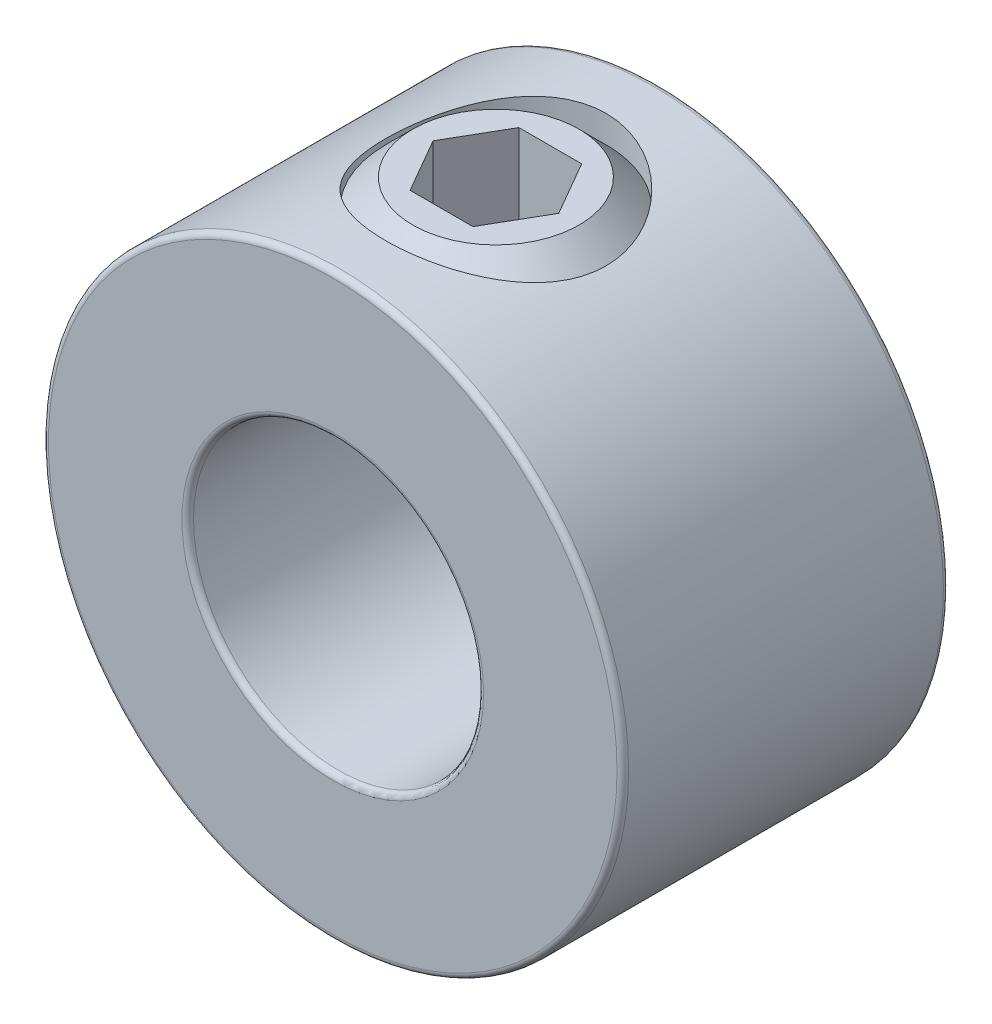
ISO-10303-21;
HEADER;
FILE_DESCRIPTION(('STEP AP214'),'2;1');
FILE_NAME('part.step','',(''),(''),'','','');
FILE_SCHEMA(('AUTOMOTIVE_DESIGN { 1 0 10303 214 1 1 1 1 }'));
ENDSEC;
DATA;
#1=APPLICATION_CONTEXT('core data for automotive mechanical design processes');
#2=APPLICATION_PROTOCOL_DEFINITION('international standard','automotive_design',2000,#1);
#3=PRODUCT_CONTEXT('',#1,'mechanical');
#4=PRODUCT('Part','Part','',(#3));
#5=PRODUCT_RELATED_PRODUCT_CATEGORY('part','',(#4));
#6=PRODUCT_DEFINITION_FORMATION('','',#4);
#7=PRODUCT_DEFINITION_CONTEXT('part definition',#1,'design');
#8=PRODUCT_DEFINITION('design','',#6,#7);
#9=PRODUCT_DEFINITION_SHAPE('','',#8);
#10=(LENGTH_UNIT() NAMED_UNIT(*) SI_UNIT(.MILLI.,.METRE.));
#11=(NAMED_UNIT(*) PLANE_ANGLE_UNIT() SI_UNIT($,.RADIAN.));
#12=(NAMED_UNIT(*) SI_UNIT($,.STERADIAN.) SOLID_ANGLE_UNIT());
#13=UNCERTAINTY_MEASURE_WITH_UNIT(LENGTH_MEASURE(1.E-05),#10,'distance_accuracy_value','');
#14=(GEOMETRIC_REPRESENTATION_CONTEXT(3) GLOBAL_UNCERTAINTY_ASSIGNED_CONTEXT((#13)) GLOBAL_UNIT_ASSIGNED_CONTEXT((#10,
#11,#12)) REPRESENTATION_CONTEXT('',''));
#15=CARTESIAN_POINT('',(0.,0.,0.));
#16=DIRECTION('',(0.,0.,1.));
#17=DIRECTION('',(1.,0.,0.));
#18=AXIS2_PLACEMENT_3D('',#15,#16,#17);
#19=CARTESIAN_POINT('',(0.,6.35,0.));
#20=DIRECTION('',(0.,1.,0.));
#21=DIRECTION('',(-1.,0.,0.));
#22=AXIS2_PLACEMENT_3D('',#19,#20,#21);
#23=PLANE('',#22);
#24=CARTESIAN_POINT('',(0.,6.35,0.));
#25=DIRECTION('',(0.,1.,0.));
#26=DIRECTION('',(-1.,0.,0.));
#27=AXIS2_PLACEMENT_3D('',#24,#25,#26);
#28=CIRCLE('',#27,1.81975161629017);
#29=CARTESIAN_POINT('',(-1.81975161629017,6.35,0.));
#30=VERTEX_POINT('',#29);
#31=EDGE_CURVE('E12',#30,#30,#28,.T.);
#32=ORIENTED_EDGE('',*,*,#31,.T.);
#33=EDGE_LOOP('',(#32));
#34=FACE_BOUND('',#33,.T.);
#35=DIRECTION('',(1.,0.,0.));
#36=VECTOR('',#35,1.);
#37=CARTESIAN_POINT('',(-0.687407664253899,6.34999999999999,-1.190625));
#38=LINE('',#37,#36);
#39=CARTESIAN_POINT('',(-0.687407664253899,6.34999999999999,-1.190625));
#40=VERTEX_POINT('',#39);
#41=CARTESIAN_POINT('',(0.687407664253899,6.35,-1.190625));
#42=VERTEX_POINT('',#41);
#43=EDGE_CURVE('E122',#40,#42,#38,.T.);
#44=ORIENTED_EDGE('',*,*,#43,.T.);
#45=DIRECTION('',(0.5,0.,0.866025403784439));
#46=VECTOR('',#45,1.);
#47=CARTESIAN_POINT('',(0.687407664253899,6.34999999999999,-1.190625));
#48=LINE('',#47,#46);
#49=CARTESIAN_POINT('',(1.3748153285078,6.34999999999999,0.));
#50=VERTEX_POINT('',#49);
#51=EDGE_CURVE('E66',#42,#50,#48,.T.);
#52=ORIENTED_EDGE('',*,*,#51,.T.);
#53=DIRECTION('',(-0.5,0.,0.866025403784439));
#54=VECTOR('',#53,1.);
#55=CARTESIAN_POINT('',(1.3748153285078,6.34999999999999,0.));
#56=LINE('',#55,#54);
#57=CARTESIAN_POINT('',(0.687407664253899,6.34999999999999,1.190625));
#58=VERTEX_POINT('',#57);
#59=EDGE_CURVE('E126',#50,#58,#56,.T.);
#60=ORIENTED_EDGE('',*,*,#59,.T.);
#61=DIRECTION('',(-1.,0.,0.));
#62=VECTOR('',#61,1.);
#63=CARTESIAN_POINT('',(0.687407664253899,6.34999999999999,1.190625));
#64=LINE('',#63,#62);
#65=CARTESIAN_POINT('',(-0.687407664253899,6.34999999999999,1.190625));
#66=VERTEX_POINT('',#65);
#67=EDGE_CURVE('E205',#58,#66,#64,.T.);
#68=ORIENTED_EDGE('',*,*,#67,.T.);
#69=DIRECTION('',(-0.5,0.,-0.866025403784439));
#70=VECTOR('',#69,1.);
#71=CARTESIAN_POINT('',(-0.687407664253899,6.34999999999999,1.190625));
#72=LINE('',#71,#70);
#73=CARTESIAN_POINT('',(-1.3748153285078,6.34999999999999,0.));
#74=VERTEX_POINT('',#73);
#75=EDGE_CURVE('E185',#66,#74,#72,.T.);
#76=ORIENTED_EDGE('',*,*,#75,.T.);
#77=DIRECTION('',(0.5,0.,-0.866025403784439));
#78=VECTOR('',#77,1.);
#79=CARTESIAN_POINT('',(-1.3748153285078,6.34999999999999,0.));
#80=LINE('',#79,#78);
#81=EDGE_CURVE('E178',#74,#40,#80,.T.);
#82=ORIENTED_EDGE('',*,*,#81,.T.);
#83=EDGE_LOOP('',(#44,#52,#60,#68,#76,#82));
#84=FACE_BOUND('',#83,.T.);
#85=ADVANCED_FACE('F51',(#34,#84),#23,.T.);
#86=CARTESIAN_POINT('',(0.,6.35,0.));
#87=DIRECTION('',(0.,-1.,0.));
#88=DIRECTION('',(1.,0.,0.));
#89=AXIS2_PLACEMENT_3D('',#86,#87,#88);
#90=CONICAL_SURFACE('',#89,1.81975161629017,0.785398163397449);
#91=CARTESIAN_POINT('',(0.,5.75675161629017,0.));
#92=DIRECTION('',(0.,1.,0.));
#93=DIRECTION('',(-1.,0.,0.));
#94=AXIS2_PLACEMENT_3D('',#91,#92,#93);
#95=CIRCLE('',#94,2.413);
#96=CARTESIAN_POINT('',(-2.413,5.75675161629017,0.));
#97=VERTEX_POINT('',#96);
#98=EDGE_CURVE('E59',#97,#97,#95,.T.);
#99=ORIENTED_EDGE('',*,*,#98,.T.);
#100=EDGE_LOOP('',(#99));
#101=FACE_BOUND('',#100,.T.);
#102=ORIENTED_EDGE('',*,*,#31,.F.);
#103=EDGE_LOOP('',(#102));
#104=FACE_BOUND('',#103,.T.);
#105=ADVANCED_FACE('F152',(#101,#104),#90,.T.);
#106=CARTESIAN_POINT('',(0.,3.175,0.));
#107=DIRECTION('',(0.,1.,0.));
#108=DIRECTION('',(-1.,0.,0.));
#109=AXIS2_PLACEMENT_3D('',#106,#107,#108);
#110=CYLINDRICAL_SURFACE('',#109,2.413);
#111=CARTESIAN_POINT('',(0.,3.76824838370983,0.));
#112=DIRECTION('',(0.,1.,0.));
#113=DIRECTION('',(-1.,0.,0.));
#114=AXIS2_PLACEMENT_3D('',#111,#112,#113);
#115=CIRCLE('',#114,2.413);
#116=CARTESIAN_POINT('',(-2.413,3.76824838370983,0.));
#117=VERTEX_POINT('',#116);
#118=EDGE_CURVE('E144',#117,#117,#115,.T.);
#119=ORIENTED_EDGE('',*,*,#118,.T.);
#120=EDGE_LOOP('',(#119));
#121=FACE_BOUND('',#120,.T.);
#122=ORIENTED_EDGE('',*,*,#98,.F.);
#123=EDGE_LOOP('',(#122));
#124=FACE_BOUND('',#123,.T.);
#125=ADVANCED_FACE('F155',(#121,#124),#110,.T.);
#126=CARTESIAN_POINT('',(0.,3.76824838370983,0.));
#127=DIRECTION('',(0.,1.,0.));
#128=DIRECTION('',(-1.,0.,0.));
#129=AXIS2_PLACEMENT_3D('',#126,#127,#128);
#130=CONICAL_SURFACE('',#129,2.413,0.785398163397448);
#131=CARTESIAN_POINT('',(0.,3.175,0.));
#132=DIRECTION('',(0.,1.,0.));
#133=DIRECTION('',(-1.,0.,0.));
#134=AXIS2_PLACEMENT_3D('',#131,#132,#133);
#135=CIRCLE('',#134,1.81975161629017);
#136=CARTESIAN_POINT('',(-1.81975161629017,3.175,0.));
#137=VERTEX_POINT('',#136);
#138=EDGE_CURVE('E135',#137,#137,#135,.T.);
#139=ORIENTED_EDGE('',*,*,#138,.T.);
#140=EDGE_LOOP('',(#139));
#141=FACE_BOUND('',#140,.T.);
#142=ORIENTED_EDGE('',*,*,#118,.F.);
#143=EDGE_LOOP('',(#142));
#144=FACE_BOUND('',#143,.T.);
#145=ADVANCED_FACE('F157',(#141,#144),#130,.T.);
#146=CARTESIAN_POINT('',(-1.81975161629017,3.175,0.));
#147=DIRECTION('',(0.,-1.,0.));
#148=DIRECTION('',(1.,0.,0.));
#149=AXIS2_PLACEMENT_3D('',#146,#147,#148);
#150=PLANE('',#149);
#151=CARTESIAN_POINT('',(0.,3.175,0.));
#152=DIRECTION('',(0.,1.,0.));
#153=DIRECTION('',(-1.,0.,0.));
#154=AXIS2_PLACEMENT_3D('',#151,#152,#153);
#155=CIRCLE('',#154,0.711898060451796);
#156=CARTESIAN_POINT('',(-0.711898060451796,3.175,0.));
#157=VERTEX_POINT('',#156);
#158=EDGE_CURVE('E128',#157,#157,#155,.T.);
#159=ORIENTED_EDGE('',*,*,#158,.T.);
#160=EDGE_LOOP('',(#159));
#161=FACE_BOUND('',#160,.T.);
#162=ORIENTED_EDGE('',*,*,#138,.F.);
#163=EDGE_LOOP('',(#162));
#164=FACE_BOUND('',#163,.T.);
#165=ADVANCED_FACE('F164',(#161,#164),#150,.T.);
#166=CARTESIAN_POINT('',(0.,3.175,0.));
#167=DIRECTION('',(0.,-1.,0.));
#168=DIRECTION('',(1.,0.,0.));
#169=AXIS2_PLACEMENT_3D('',#166,#167,#168);
#170=CONICAL_SURFACE('',#169,0.711898060451796,0.785398163397448);
#171=CARTESIAN_POINT('',(0.,3.8868980604518,0.));
#172=VERTEX_POINT('',#171);
#173=VERTEX_LOOP('',#172);
#174=FACE_BOUND('',#173,.T.);
#175=ORIENTED_EDGE('',*,*,#158,.F.);
#176=EDGE_LOOP('',(#175));
#177=FACE_BOUND('',#176,.T.);
#178=ADVANCED_FACE('F257',(#174,#177),#170,.F.);
#179=CARTESIAN_POINT('',(0.687407664253899,3.96874999999999,-1.190625));
#180=DIRECTION('',(-0.866025403784439,0.,0.5));
#181=DIRECTION('',(0.5,0.,0.866025403784438));
#182=AXIS2_PLACEMENT_3D('',#179,#180,#181);
#183=PLANE('',#182);
#184=ORIENTED_EDGE('',*,*,#51,.F.);
#185=DIRECTION('',(0.,1.,0.));
#186=VECTOR('',#185,1.);
#187=CARTESIAN_POINT('',(0.687407664253899,3.96874999999999,-1.190625));
#188=LINE('',#187,#186);
#189=CARTESIAN_POINT('',(0.687407664253899,3.96874999999999,-1.190625));
#190=VERTEX_POINT('',#189);
#191=EDGE_CURVE('E120',#190,#42,#188,.T.);
#192=ORIENTED_EDGE('',*,*,#191,.F.);
#193=DIRECTION('',(0.5,0.,0.866025403784439));
#194=VECTOR('',#193,1.);
#195=CARTESIAN_POINT('',(0.687407664253899,3.96874999999999,-1.190625));
#196=LINE('',#195,#194);
#197=CARTESIAN_POINT('',(1.3748153285078,3.96874999999999,0.));
#198=VERTEX_POINT('',#197);
#199=EDGE_CURVE('E110',#190,#198,#196,.T.);
#200=ORIENTED_EDGE('',*,*,#199,.T.);
#201=DIRECTION('',(0.,1.,0.));
#202=VECTOR('',#201,1.);
#203=CARTESIAN_POINT('',(1.3748153285078,3.96874999999999,0.));
#204=LINE('',#203,#202);
#205=EDGE_CURVE('E119',#198,#50,#204,.T.);
#206=ORIENTED_EDGE('',*,*,#205,.T.);
#207=EDGE_LOOP('',(#184,#192,#200,#206));
#208=FACE_BOUND('',#207,.T.);
#209=ADVANCED_FACE('F118',(#208),#183,.T.);
#210=CARTESIAN_POINT('',(1.3748153285078,3.96874999999999,0.));
#211=DIRECTION('',(-0.866025403784439,0.,-0.5));
#212=DIRECTION('',(-0.5,0.,0.866025403784439));
#213=AXIS2_PLACEMENT_3D('',#210,#211,#212);
#214=PLANE('',#213);
#215=ORIENTED_EDGE('',*,*,#59,.F.);
#216=ORIENTED_EDGE('',*,*,#205,.F.);
#217=DIRECTION('',(-0.5,0.,0.866025403784439));
#218=VECTOR('',#217,1.);
#219=CARTESIAN_POINT('',(1.3748153285078,3.96874999999999,0.));
#220=LINE('',#219,#218);
#221=CARTESIAN_POINT('',(0.687407664253899,3.96874999999999,1.190625));
#222=VERTEX_POINT('',#221);
#223=EDGE_CURVE('E106',#198,#222,#220,.T.);
#224=ORIENTED_EDGE('',*,*,#223,.T.);
#225=DIRECTION('',(0.,1.,0.));
#226=VECTOR('',#225,1.);
#227=CARTESIAN_POINT('',(0.687407664253899,3.96874999999999,1.190625));
#228=LINE('',#227,#226);
#229=EDGE_CURVE('E129',#222,#58,#228,.T.);
#230=ORIENTED_EDGE('',*,*,#229,.T.);
#231=EDGE_LOOP('',(#215,#216,#224,#230));
#232=FACE_BOUND('',#231,.T.);
#233=ADVANCED_FACE('F124',(#232),#214,.T.);
#234=CARTESIAN_POINT('',(0.687407664253899,3.96874999999999,1.190625));
#235=DIRECTION('',(0.,0.,-1.));
#236=DIRECTION('',(-1.,0.,0.));
#237=AXIS2_PLACEMENT_3D('',#234,#235,#236);
#238=PLANE('',#237);
#239=ORIENTED_EDGE('',*,*,#67,.F.);
#240=ORIENTED_EDGE('',*,*,#229,.F.);
#241=DIRECTION('',(-1.,0.,0.));
#242=VECTOR('',#241,1.);
#243=CARTESIAN_POINT('',(0.687407664253899,3.96874999999999,1.190625));
#244=LINE('',#243,#242);
#245=CARTESIAN_POINT('',(-0.687407664253899,3.96874999999999,1.190625));
#246=VERTEX_POINT('',#245);
#247=EDGE_CURVE('E112',#222,#246,#244,.T.);
#248=ORIENTED_EDGE('',*,*,#247,.T.);
#249=DIRECTION('',(0.,1.,0.));
#250=VECTOR('',#249,1.);
#251=CARTESIAN_POINT('',(-0.687407664253899,3.96874999999999,1.190625));
#252=LINE('',#251,#250);
#253=EDGE_CURVE('E137',#246,#66,#252,.T.);
#254=ORIENTED_EDGE('',*,*,#253,.T.);
#255=EDGE_LOOP('',(#239,#240,#248,#254));
#256=FACE_BOUND('',#255,.T.);
#257=ADVANCED_FACE('F203',(#256),#238,.T.);
#258=CARTESIAN_POINT('',(-0.687407664253899,3.96874999999999,1.190625));
#259=DIRECTION('',(0.866025403784439,0.,-0.5));
#260=DIRECTION('',(-0.5,0.,-0.866025403784438));
#261=AXIS2_PLACEMENT_3D('',#258,#259,#260);
#262=PLANE('',#261);
#263=ORIENTED_EDGE('',*,*,#75,.F.);
#264=ORIENTED_EDGE('',*,*,#253,.F.);
#265=DIRECTION('',(-0.5,0.,-0.866025403784439));
#266=VECTOR('',#265,1.);
#267=CARTESIAN_POINT('',(-0.687407664253899,3.96874999999999,1.190625));
#268=LINE('',#267,#266);
#269=CARTESIAN_POINT('',(-1.3748153285078,3.96874999999999,0.));
#270=VERTEX_POINT('',#269);
#271=EDGE_CURVE('E223',#246,#270,#268,.T.);
#272=ORIENTED_EDGE('',*,*,#271,.T.);
#273=DIRECTION('',(0.,1.,0.));
#274=VECTOR('',#273,1.);
#275=CARTESIAN_POINT('',(-1.3748153285078,3.96874999999999,0.));
#276=LINE('',#275,#274);
#277=EDGE_CURVE('E195',#270,#74,#276,.T.);
#278=ORIENTED_EDGE('',*,*,#277,.T.);
#279=EDGE_LOOP('',(#263,#264,#272,#278));
#280=FACE_BOUND('',#279,.T.);
#281=ADVANCED_FACE('F207',(#280),#262,.T.);
#282=CARTESIAN_POINT('',(-1.3748153285078,3.96874999999999,0.));
#283=DIRECTION('',(0.866025403784439,0.,0.5));
#284=DIRECTION('',(0.5,0.,-0.866025403784439));
#285=AXIS2_PLACEMENT_3D('',#282,#283,#284);
#286=PLANE('',#285);
#287=ORIENTED_EDGE('',*,*,#81,.F.);
#288=ORIENTED_EDGE('',*,*,#277,.F.);
#289=DIRECTION('',(0.5,0.,-0.866025403784439));
#290=VECTOR('',#289,1.);
#291=CARTESIAN_POINT('',(-1.3748153285078,3.96874999999999,0.));
#292=LINE('',#291,#290);
#293=CARTESIAN_POINT('',(-0.687407664253899,3.96874999999999,-1.190625));
#294=VERTEX_POINT('',#293);
#295=EDGE_CURVE('E220',#270,#294,#292,.T.);
#296=ORIENTED_EDGE('',*,*,#295,.T.);
#297=DIRECTION('',(0.,1.,0.));
#298=VECTOR('',#297,1.);
#299=CARTESIAN_POINT('',(-0.687407664253899,3.96874999999999,-1.190625));
#300=LINE('',#299,#298);
#301=EDGE_CURVE('E191',#294,#40,#300,.T.);
#302=ORIENTED_EDGE('',*,*,#301,.T.);
#303=EDGE_LOOP('',(#287,#288,#296,#302));
#304=FACE_BOUND('',#303,.T.);
#305=ADVANCED_FACE('F238',(#304),#286,.T.);
#306=CARTESIAN_POINT('',(-0.687407664253899,3.96874999999999,-1.190625));
#307=DIRECTION('',(0.,0.,1.));
#308=DIRECTION('',(1.,0.,0.));
#309=AXIS2_PLACEMENT_3D('',#306,#307,#308);
#310=PLANE('',#309);
#311=ORIENTED_EDGE('',*,*,#43,.F.);
#312=ORIENTED_EDGE('',*,*,#301,.F.);
#313=DIRECTION('',(1.,0.,0.));
#314=VECTOR('',#313,1.);
#315=CARTESIAN_POINT('',(-0.687407664253899,3.96874999999999,-1.190625));
#316=LINE('',#315,#314);
#317=EDGE_CURVE('E192',#294,#190,#316,.T.);
#318=ORIENTED_EDGE('',*,*,#317,.T.);
#319=ORIENTED_EDGE('',*,*,#191,.T.);
#320=EDGE_LOOP('',(#311,#312,#318,#319));
#321=FACE_BOUND('',#320,.T.);
#322=ADVANCED_FACE('F239',(#321),#310,.T.);
#323=CARTESIAN_POINT('',(1.3748153285078,3.96874999999999,0.));
#324=DIRECTION('',(0.,-1.,0.));
#325=DIRECTION('',(0.,0.,-1.));
#326=AXIS2_PLACEMENT_3D('',#323,#324,#325);
#327=PLANE('',#326);
#328=ORIENTED_EDGE('',*,*,#199,.F.);
#329=ORIENTED_EDGE('',*,*,#317,.F.);
#330=ORIENTED_EDGE('',*,*,#295,.F.);
#331=ORIENTED_EDGE('',*,*,#271,.F.);
#332=ORIENTED_EDGE('',*,*,#247,.F.);
#333=ORIENTED_EDGE('',*,*,#223,.F.);
#334=EDGE_LOOP('',(#328,#329,#330,#331,#332,#333));
#335=FACE_BOUND('',#334,.T.);
#336=ADVANCED_FACE('F108',(#335),#327,.F.);
#337=CLOSED_SHELL('',(#85,#105,#125,#145,#165,#178,#209,#233,#257,#281,#305,#322,#336));
#338=MANIFOLD_SOLID_BREP('B2',#337);
#339=CARTESIAN_POINT('',(0.,0.,3.571875));
#340=DIRECTION('',(0.,0.,1.));
#341=DIRECTION('',(1.,0.,0.));
#342=AXIS2_PLACEMENT_3D('',#339,#340,#341);
#343=PLANE('',#342);
#344=CARTESIAN_POINT('',(0.,0.,3.571875));
#345=DIRECTION('',(0.,0.,1.));
#346=DIRECTION('',(1.,0.,0.));
#347=AXIS2_PLACEMENT_3D('',#344,#345,#346);
#348=CIRCLE('',#347,3.302);
#349=CARTESIAN_POINT('',(3.302,0.,3.571875));
#350=VERTEX_POINT('',#349);
#351=EDGE_CURVE('E366',#350,#350,#348,.F.);
#352=ORIENTED_EDGE('',*,*,#351,.T.);
#353=EDGE_LOOP('',(#352));
#354=FACE_BOUND('',#353,.T.);
#355=CARTESIAN_POINT('',(0.,0.,3.571875));
#356=DIRECTION('',(0.,0.,1.));
#357=DIRECTION('',(1.,0.,0.));
#358=AXIS2_PLACEMENT_3D('',#355,#356,#357);
#359=CIRCLE('',#358,6.223);
#360=CARTESIAN_POINT('',(6.223,0.,3.571875));
#361=VERTEX_POINT('',#360);
#362=EDGE_CURVE('E372',#361,#361,#359,.T.);
#363=ORIENTED_EDGE('',*,*,#362,.T.);
#364=EDGE_LOOP('',(#363));
#365=FACE_BOUND('',#364,.T.);
#366=ADVANCED_FACE('F352',(#354,#365),#343,.T.);
#367=CARTESIAN_POINT('',(0.,0.,-3.571875));
#368=DIRECTION('',(0.,0.,1.));
#369=DIRECTION('',(1.,0.,0.));
#370=AXIS2_PLACEMENT_3D('',#367,#368,#369);
#371=PLANE('',#370);
#372=CARTESIAN_POINT('',(0.,0.,-3.571875));
#373=DIRECTION('',(0.,0.,1.));
#374=DIRECTION('',(1.,0.,0.));
#375=AXIS2_PLACEMENT_3D('',#372,#373,#374);
#376=CIRCLE('',#375,3.302);
#377=CARTESIAN_POINT('',(3.302,0.,-3.571875));
#378=VERTEX_POINT('',#377);
#379=EDGE_CURVE('E386',#378,#378,#376,.T.);
#380=ORIENTED_EDGE('',*,*,#379,.T.);
#381=EDGE_LOOP('',(#380));
#382=FACE_BOUND('',#381,.T.);
#383=CARTESIAN_POINT('',(0.,0.,-3.571875));
#384=DIRECTION('',(0.,0.,1.));
#385=DIRECTION('',(1.,0.,0.));
#386=AXIS2_PLACEMENT_3D('',#383,#384,#385);
#387=CIRCLE('',#386,6.223);
#388=CARTESIAN_POINT('',(6.223,0.,-3.571875));
#389=VERTEX_POINT('',#388);
#390=EDGE_CURVE('E390',#389,#389,#387,.F.);
#391=ORIENTED_EDGE('',*,*,#390,.T.);
#392=EDGE_LOOP('',(#391));
#393=FACE_BOUND('',#392,.T.);
#394=ADVANCED_FACE('F428',(#382,#393),#371,.F.);
#395=CARTESIAN_POINT('',(0.,0.,3.571875));
#396=DIRECTION('',(0.,0.,-1.));
#397=DIRECTION('',(-1.,0.,0.));
#398=AXIS2_PLACEMENT_3D('',#395,#396,#397);
#399=CYLINDRICAL_SURFACE('',#398,6.35);
#400=CARTESIAN_POINT('',(0.,0.,-3.444875));
#401=DIRECTION('',(0.,0.,1.));
#402=DIRECTION('',(1.,0.,0.));
#403=AXIS2_PLACEMENT_3D('',#400,#401,#402);
#404=CIRCLE('',#403,6.35);
#405=CARTESIAN_POINT('',(6.35,0.,-3.444875));
#406=VERTEX_POINT('',#405);
#407=EDGE_CURVE('E50',#406,#406,#404,.T.);
#408=ORIENTED_EDGE('',*,*,#407,.T.);
#409=EDGE_LOOP('',(#408));
#410=FACE_BOUND('',#409,.T.);
#411=CARTESIAN_POINT('',(0.,0.,3.444875));
#412=DIRECTION('',(0.,0.,1.));
#413=DIRECTION('',(1.,0.,0.));
#414=AXIS2_PLACEMENT_3D('',#411,#412,#413);
#415=CIRCLE('',#414,6.35);
#416=CARTESIAN_POINT('',(6.35,0.,3.444875));
#417=VERTEX_POINT('',#416);
#418=EDGE_CURVE('E360',#417,#417,#415,.F.);
#419=ORIENTED_EDGE('',*,*,#418,.T.);
#420=EDGE_LOOP('',(#419));
#421=FACE_BOUND('',#420,.T.);
#422=CARTESIAN_POINT('',(0.,6.35,-2.413));
#423=CARTESIAN_POINT('',(0.130555931467962,6.35000398969011,-2.41300527534602));
#424=CARTESIAN_POINT('',(0.261076241377739,6.34593890816647,-2.4023714543113));
#425=CARTESIAN_POINT('',(0.518209446534913,6.33012963929965,-2.36029479676423));
#426=CARTESIAN_POINT('',(0.644823015088655,6.31838678300935,-2.32885556715778));
#427=CARTESIAN_POINT('',(0.890396734122701,6.28848040494,-2.24644511602075));
#428=CARTESIAN_POINT('',(1.00937135935963,6.27032947705095,-2.19551218938446));
#429=CARTESIAN_POINT('',(1.23707694907279,6.22940932060409,-2.07575764561934));
#430=CARTESIAN_POINT('',(1.34580507871092,6.20663881943741,-2.00693109764769));
#431=CARTESIAN_POINT('',(1.5546544090621,6.15771932779737,-1.85022277092613));
#432=CARTESIAN_POINT('',(1.65427192875035,6.13147296383124,-1.76170041624995));
#433=CARTESIAN_POINT('',(1.83765571561736,6.07903240405007,-1.56947315042905));
#434=CARTESIAN_POINT('',(1.92141693988139,6.05283822744466,-1.46576342765122));
#435=CARTESIAN_POINT('',(2.07395660623911,6.00232668170519,-1.24113386470124));
#436=CARTESIAN_POINT('',(2.14201618015845,5.97812365120729,-1.11969756154783));
#437=CARTESIAN_POINT('',(2.25652093858858,5.93585432476053,-0.866038380432351));
#438=CARTESIAN_POINT('',(2.30297502037546,5.91778550353544,-0.733819969020803));
#439=CARTESIAN_POINT('',(2.37094947712185,5.89087364983883,-0.46815363189803));
#440=CARTESIAN_POINT('',(2.39343294050412,5.88167580744491,-0.334989300795486));
#441=CARTESIAN_POINT('',(2.41583880524757,5.87251090464605,-0.0664845962936197));
#442=CARTESIAN_POINT('',(2.41577084821779,5.87253989940926,0.0688548224232351));
#443=CARTESIAN_POINT('',(2.39381090108878,5.88152011871453,0.328972227003014));
#444=CARTESIAN_POINT('',(2.37326609797153,5.88992057372023,0.453886522563246));
#445=CARTESIAN_POINT('',(2.31316652422954,5.91378008823147,0.698339704990829));
#446=CARTESIAN_POINT('',(2.27360881167116,5.92924024008996,0.817877756841903));
#447=CARTESIAN_POINT('',(2.17588364092748,5.96580146890692,1.0508916152852));
#448=CARTESIAN_POINT('',(2.11737290423754,5.98700531598431,1.16420661484106));
#449=CARTESIAN_POINT('',(1.98364217411328,6.03263175509447,1.37979639920587));
#450=CARTESIAN_POINT('',(1.90841630395244,6.05705547794376,1.4820672822727));
#451=CARTESIAN_POINT('',(1.73726689770536,6.10842961274997,1.68010694238863));
#452=CARTESIAN_POINT('',(1.64027173491613,6.13543795015635,1.77493688260015));
#453=CARTESIAN_POINT('',(1.43144868882472,6.18748920351012,1.94726806056401));
#454=CARTESIAN_POINT('',(1.31961840653187,6.2125318005324,2.02476649017818));
#455=CARTESIAN_POINT('',(1.08185265975391,6.25835188225341,2.16130771487283));
#456=CARTESIAN_POINT('',(0.955717417234618,6.27905339803369,2.22002994310971));
#457=CARTESIAN_POINT('',(0.694375189035109,6.31329326294077,2.31510736575226));
#458=CARTESIAN_POINT('',(0.559172376611221,6.32683488218724,2.3514727723643));
#459=CARTESIAN_POINT('',(0.291428150212525,6.3446501972992,2.39898109857718));
#460=CARTESIAN_POINT('',(0.159141645079808,6.34938771868047,2.41138775288999));
#461=CARTESIAN_POINT('',(-0.105693065348276,6.35049981057155,2.41431626348443));
#462=CARTESIAN_POINT('',(-0.238241203822052,6.34687629478166,2.40484312768025));
#463=CARTESIAN_POINT('',(-0.494323602805378,6.33197908606406,2.36523562382545));
#464=CARTESIAN_POINT('',(-0.61800684441211,6.32101461634214,2.33593589818825));
#465=CARTESIAN_POINT('',(-0.858609565436108,6.29285092848222,2.25861304376362));
#466=CARTESIAN_POINT('',(-0.975528163914414,6.27565090041604,2.21058748264173));
#467=CARTESIAN_POINT('',(-1.20317276582384,6.23607457125026,2.09563503714011));
#468=CARTESIAN_POINT('',(-1.3136121499673,6.21355984396609,2.02818967610491));
#469=CARTESIAN_POINT('',(-1.52197988578177,6.16583504517286,1.87689595883598));
#470=CARTESIAN_POINT('',(-1.61990351002366,6.14062396176678,1.79304143465584));
#471=CARTESIAN_POINT('',(-1.80656807112922,6.08841217199752,1.60543272496061));
#472=CARTESIAN_POINT('',(-1.89441393314817,6.06139435477813,1.5007904098217));
#473=CARTESIAN_POINT('',(-2.05148411432654,6.01005496187559,1.27772800811267));
#474=CARTESIAN_POINT('',(-2.12070651399853,5.98573366426972,1.15930650314625));
#475=CARTESIAN_POINT('',(-2.23870023772464,5.94261798623815,0.910922748538602));
#476=CARTESIAN_POINT('',(-2.28736466342468,5.92385264334907,0.780904332023381));
#477=CARTESIAN_POINT('',(-2.36177800946808,5.89458517077402,0.513602694331982));
#478=CARTESIAN_POINT('',(-2.38754162954713,5.8840777409413,0.376324193363579));
#479=CARTESIAN_POINT('',(-2.41408994040532,5.87323215610138,0.108127165215383));
#480=CARTESIAN_POINT('',(-2.41640623148607,5.87227054588007,-0.0226157343841075));
#481=CARTESIAN_POINT('',(-2.3999373204655,5.8790202253426,-0.282524873396556));
#482=CARTESIAN_POINT('',(-2.38115423316032,5.88673064582666,-0.41169126951125));
#483=CARTESIAN_POINT('',(-2.32422421188573,5.90943043237583,-0.660552265849344));
#484=CARTESIAN_POINT('',(-2.28672002796391,5.92417751295514,-0.780417919491674));
#485=CARTESIAN_POINT('',(-2.19398528189399,5.95914188552999,-1.01222145618602));
#486=CARTESIAN_POINT('',(-2.13875018285588,5.97936057736356,-1.12415730124382));
#487=CARTESIAN_POINT('',(-2.00869997639504,6.02433337271119,-1.34342800575803));
#488=CARTESIAN_POINT('',(-1.93299650808671,6.04927206356278,-1.4501976241717));
#489=CARTESIAN_POINT('',(-1.76551836882645,6.10025417003155,-1.65000619367226));
#490=CARTESIAN_POINT('',(-1.67373852090438,6.12629793945648,-1.74304070389426));
#491=CARTESIAN_POINT('',(-1.47055494697206,6.17831294001547,-1.91807209951937));
#492=CARTESIAN_POINT('',(-1.35833856072122,6.20419794006484,-1.99915556641372));
#493=CARTESIAN_POINT('',(-1.12096041375387,6.25144642675378,-2.14129762074769));
#494=CARTESIAN_POINT('',(-0.995797050693124,6.27280935273315,-2.20235372565052));
#495=CARTESIAN_POINT('',(-0.728778395788011,6.30955475572144,-2.30499263616226));
#496=CARTESIAN_POINT('',(-0.58638469778337,6.32454657619379,-2.3453288052365));
#497=CARTESIAN_POINT('',(-0.295976705251577,6.34476431329028,-2.39932232882264));
#498=CARTESIAN_POINT('',(-0.147965475024477,6.34999547828747,-2.41299402119021));
#499=CARTESIAN_POINT('',(0.,6.35,-2.413));
#500=B_SPLINE_CURVE_WITH_KNOTS('',3,(#422,#423,#424,#425,#426,#427,#428,#429,#430,#431,#432,
#433,#434,#435,#436,#437,#438,#439,#440,#441,#442,#443,#444,#445,#446,#447,#448,#449,#450,#451,
#452,#453,#454,#455,#456,#457,#458,#459,#460,#461,#462,#463,#464,#465,#466,#467,#468,#469,#470,
#471,#472,#473,#474,#475,#476,#477,#478,#479,#480,#481,#482,#483,#484,#485,#486,#487,#488,#489,
#490,#491,#492,#493,#494,#495,#496,#497,#498,#499),.UNSPECIFIED.,.T.,.F.,(4,2,2,2,2,2,2,2,2,2,2,
2,2,2,2,2,2,2,2,2,2,2,2,2,2,2,2,2,2,2,2,2,2,2,2,2,2,2,4),(0.,0.391121887064184,
0.782175985486185,1.17246577830223,1.56286323524963,1.96854634212709,2.37435825594016,
2.79613130529395,3.21773051175688,3.62166628723491,4.02542936468621,4.40427313209371,
4.78317553819666,5.16936515238192,5.55569075901495,5.96873424705112,6.38184461005431,
6.80167192308661,7.22130732355892,7.61812936188612,8.01486058335588,8.39585156202364,
8.77689204483065,9.16923685274999,9.56172942118012,9.9776135359701,10.3935404987953,
10.8116043631128,11.2293996833676,11.6197130905881,12.0099873800853,12.3876994067832,
12.7655081575183,13.1635000328781,13.5616203073395,13.9821012344605,14.4026342635628,
14.8461505355472,15.2894282569131),.UNSPECIFIED.);
#501=CARTESIAN_POINT('',(0.,6.35,-2.413));
#502=VERTEX_POINT('',#501);
#503=EDGE_CURVE('E394',#502,#502,#500,.T.);
#504=ORIENTED_EDGE('',*,*,#503,.T.);
#505=EDGE_LOOP('',(#504));
#506=FACE_BOUND('',#505,.T.);
#507=ADVANCED_FACE('F424',(#410,#421,#506),#399,.T.);
#508=CARTESIAN_POINT('',(0.,0.,3.571875));
#509=DIRECTION('',(0.,0.,-1.));
#510=DIRECTION('',(-1.,0.,0.));
#511=AXIS2_PLACEMENT_3D('',#508,#509,#510);
#512=CYLINDRICAL_SURFACE('',#511,3.175);
#513=CARTESIAN_POINT('',(0.,0.,-3.444875));
#514=DIRECTION('',(0.,0.,1.));
#515=DIRECTION('',(1.,0.,0.));
#516=AXIS2_PLACEMENT_3D('',#513,#514,#515);
#517=CIRCLE('',#516,3.175);
#518=CARTESIAN_POINT('',(3.175,0.,-3.444875));
#519=VERTEX_POINT('',#518);
#520=EDGE_CURVE('E378',#519,#519,#517,.F.);
#521=ORIENTED_EDGE('',*,*,#520,.T.);
#522=EDGE_LOOP('',(#521));
#523=FACE_BOUND('',#522,.T.);
#524=CARTESIAN_POINT('',(0.,0.,3.444875));
#525=DIRECTION('',(0.,0.,1.));
#526=DIRECTION('',(1.,0.,0.));
#527=AXIS2_PLACEMENT_3D('',#524,#525,#526);
#528=CIRCLE('',#527,3.175);
#529=CARTESIAN_POINT('',(3.175,0.,3.444875));
#530=VERTEX_POINT('',#529);
#531=EDGE_CURVE('E382',#530,#530,#528,.T.);
#532=ORIENTED_EDGE('',*,*,#531,.T.);
#533=EDGE_LOOP('',(#532));
#534=FACE_BOUND('',#533,.T.);
#535=CARTESIAN_POINT('',(0.,3.175,-2.413));
#536=CARTESIAN_POINT('',(0.117443171605231,3.17499092904906,-2.41299058031907));
#537=CARTESIAN_POINT('',(0.23503818841931,3.16841692674332,-2.4043581847269));
#538=CARTESIAN_POINT('',(0.466484967913331,3.14271336140829,-2.37038175457781));
#539=CARTESIAN_POINT('',(0.580328596183407,3.12355818632314,-2.34500362950094));
#540=CARTESIAN_POINT('',(0.80033693546367,3.07452724978738,-2.27928432631256));
#541=CARTESIAN_POINT('',(0.906543039514099,3.04471549355359,-2.23903243487973));
#542=CARTESIAN_POINT('',(1.10997011785933,2.97659455342082,-2.14548015839209));
#543=CARTESIAN_POINT('',(1.20719255384311,2.93828675533249,-2.09218190121579));
#544=CARTESIAN_POINT('',(1.40022726688529,2.85170030734834,-1.96882085307546));
#545=CARTESIAN_POINT('',(1.49506365463583,2.80282512985173,-1.89765858122501));
#546=CARTESIAN_POINT('',(1.67223382567996,2.7008760546092,-1.7435641158176));
#547=CARTESIAN_POINT('',(1.75454859398162,2.64779595363648,-1.66061438438314));
#548=CARTESIAN_POINT('',(1.92203888294129,2.5296135351956,-1.46565859240837));
#549=CARTESIAN_POINT('',(2.00423140536036,2.4643124367144,-1.35120048467098));
#550=CARTESIAN_POINT('',(2.14857118710811,2.33951215894306,-1.10735736644856));
#551=CARTESIAN_POINT('',(2.21074385995913,2.28000569136514,-0.977991565717825));
#552=CARTESIAN_POINT('',(2.29462037317499,2.19490180220151,-0.752497308608559));
#553=CARTESIAN_POINT('',(2.32287346332998,2.16472241167552,-0.66055827907226));
#554=CARTESIAN_POINT('',(2.36849823013454,2.11470881226284,-0.47139038700259));
#555=CARTESIAN_POINT('',(2.38589523743028,2.09485053921884,-0.374174418255039));
#556=CARTESIAN_POINT('',(2.40870358471578,2.06860028206587,-0.175460476777278));
#557=CARTESIAN_POINT('',(2.4139959431512,2.06234200752845,-0.073929905731699));
#558=CARTESIAN_POINT('',(2.41169213967819,2.06503422028968,0.128798184800726));
#559=CARTESIAN_POINT('',(2.40409306334661,2.07398814667793,0.22999562379254));
#560=CARTESIAN_POINT('',(2.37836508518799,2.10340433920656,0.416917246134645));
#561=CARTESIAN_POINT('',(2.36156171265492,2.1224091464969,0.503073429560243));
#562=CARTESIAN_POINT('',(2.31942910669347,2.16837457604816,0.671064962974234));
#563=CARTESIAN_POINT('',(2.29409116468348,2.19534332114491,0.752895800354834));
#564=CARTESIAN_POINT('',(2.21702947004233,2.27376916611904,0.962631680289748));
#565=CARTESIAN_POINT('',(2.15880606368402,2.32983777456744,1.08642083974007));
#566=CARTESIAN_POINT('',(2.0240584670168,2.44783368287627,1.32063556736185));
#567=CARTESIAN_POINT('',(1.94748865288627,2.50977535205404,1.43102676980356));
#568=CARTESIAN_POINT('',(1.77457755480707,2.63500191833982,1.64086400526623));
#569=CARTESIAN_POINT('',(1.67772908569284,2.69827393808612,1.73990181478264));
#570=CARTESIAN_POINT('',(1.46641465679805,2.81868720555883,1.92133244794249));
#571=CARTESIAN_POINT('',(1.35198192561174,2.87583967861316,2.00375600179513));
#572=CARTESIAN_POINT('',(1.1302184691796,2.96897239724258,2.13504920976438));
#573=CARTESIAN_POINT('',(1.02573469648465,3.00691100546587,2.18732233798596));
#574=CARTESIAN_POINT('',(0.807524498934965,3.07269924184988,2.27691743542351));
#575=CARTESIAN_POINT('',(0.693803632023793,3.10055488265641,2.31424831636675));
#576=CARTESIAN_POINT('',(0.458986561176873,3.14392869528766,2.37204565582169));
#577=CARTESIAN_POINT('',(0.337846653718269,3.15936426972399,2.39239924216467));
#578=CARTESIAN_POINT('',(0.0929212408274502,3.17600778354888,2.41433718167044));
#579=CARTESIAN_POINT('',(-0.0308628412677098,3.17722319336241,2.41593138989231));
#580=CARTESIAN_POINT('',(-0.263113673769308,3.16598164725166,2.40112430213952));
#581=CARTESIAN_POINT('',(-0.371784896474092,3.15499411480433,2.38665711938384));
#582=CARTESIAN_POINT('',(-0.584657379974265,3.12256258934286,2.34361709819449));
#583=CARTESIAN_POINT('',(-0.688857782558675,3.10111659842469,2.31504156459624));
#584=CARTESIAN_POINT('',(-0.893151752270642,3.04866013703249,2.24429284461138));
#585=CARTESIAN_POINT('',(-0.993066473951875,3.01741404656932,2.20178337061745));
#586=CARTESIAN_POINT('',(-1.18427030490273,2.94762615076737,2.10512741976429));
#587=CARTESIAN_POINT('',(-1.27555811070553,2.90908324556455,2.05097918840424));
#588=CARTESIAN_POINT('',(-1.4629408219305,2.82008518778891,1.92283493337221));
#589=CARTESIAN_POINT('',(-1.55736336530955,2.76871323654288,1.84703979297132));
#590=CARTESIAN_POINT('',(-1.7330266340156,2.66229345480278,1.68334400808498));
#591=CARTESIAN_POINT('',(-1.81424018707203,2.60723836781931,1.59541908083344));
#592=CARTESIAN_POINT('',(-1.93310120506622,2.51929011373857,1.44596227809647));
#593=CARTESIAN_POINT('',(-1.97518148865632,2.48634042838264,1.38794003709871));
#594=CARTESIAN_POINT('',(-2.05424288960517,2.42143291492003,1.26799956797446));
#595=CARTESIAN_POINT('',(-2.09122218168265,2.38947544500995,1.2060799567393));
#596=CARTESIAN_POINT('',(-2.19405069763864,2.29677780916441,1.01470921513655));
#597=CARTESIAN_POINT('',(-2.25209423008379,2.2389759481709,0.879267670433414));
#598=CARTESIAN_POINT('',(-2.32600727289693,2.16148731453314,0.648667618119571));
#599=CARTESIAN_POINT('',(-2.34951337659766,2.13568591161393,0.557995127674168));
#600=CARTESIAN_POINT('',(-2.38597736286025,2.09487284834006,0.372275602812797));
#601=CARTESIAN_POINT('',(-2.39896041795918,2.0798354491901,0.277239585981548));
#602=CARTESIAN_POINT('',(-2.41347202601588,2.06298898322372,0.0843820043038626));
#603=CARTESIAN_POINT('',(-2.41491881071071,2.06127434940024,-0.0134545208329241));
#604=CARTESIAN_POINT('',(-2.40600289841214,2.07166816759277,-0.20788213648133));
#605=CARTESIAN_POINT('',(-2.39562846174622,2.08379036100337,-0.304471892411458));
#606=CARTESIAN_POINT('',(-2.36137219311358,2.12256830664758,-0.508834367656112));
#607=CARTESIAN_POINT('',(-2.33557340769404,2.15126142901359,-0.615881798172457));
#608=CARTESIAN_POINT('',(-2.27108364148613,2.21923176610734,-0.822515613730422));
#609=CARTESIAN_POINT('',(-2.2323592210675,2.25853638265596,-0.922081817130457));
#610=CARTESIAN_POINT('',(-2.12610942507655,2.35955877527054,-1.15053309693759));
#611=CARTESIAN_POINT('',(-2.05324191025264,2.42403799567888,-1.27569998264042));
#612=CARTESIAN_POINT('',(-1.88728411653423,2.55539518076956,-1.5104318596925));
#613=CARTESIAN_POINT('',(-1.79417076882036,2.62227580852244,-1.61997881541957));
#614=CARTESIAN_POINT('',(-1.58693666845894,2.75272337581287,-1.82362287315767));
#615=CARTESIAN_POINT('',(-1.47252844795802,2.81622750409905,-1.9174704362987));
#616=CARTESIAN_POINT('',(-1.22472214874906,2.93245405690648,-2.0844185884594));
#617=CARTESIAN_POINT('',(-1.09136873492959,2.9852011492147,-2.15756679766189));
#618=CARTESIAN_POINT('',(-0.848324156263042,3.06143310070406,-2.2616762509508));
#619=CARTESIAN_POINT('',(-0.742491250018576,3.08897584082985,-2.29871569194653));
#620=CARTESIAN_POINT('',(-0.524711420429954,3.13329848559572,-2.35794338327758));
#621=CARTESIAN_POINT('',(-0.412780537897338,3.1501052759874,-2.38016873825137));
#622=CARTESIAN_POINT('',(-0.249887399880881,3.16554486424948,-2.40054788675386));
#623=CARTESIAN_POINT('',(-0.200104041382905,3.16908209053624,-2.40520884201812));
#624=CARTESIAN_POINT('',(-0.10022305414221,3.17381185752955,-2.41143725628489));
#625=CARTESIAN_POINT('',(-0.0501253573366512,3.17500387152911,-2.41300402036888));
#626=CARTESIAN_POINT('',(0.,3.175,-2.413));
#627=B_SPLINE_CURVE_WITH_KNOTS('',3,(#535,#536,#537,#538,#539,#540,#541,#542,#543,#544,#545,
#546,#547,#548,#549,#550,#551,#552,#553,#554,#555,#556,#557,#558,#559,#560,#561,#562,#563,#564,
#565,#566,#567,#568,#569,#570,#571,#572,#573,#574,#575,#576,#577,#578,#579,#580,#581,#582,#583,
#584,#585,#586,#587,#588,#589,#590,#591,#592,#593,#594,#595,#596,#597,#598,#599,#600,#601,#602,
#603,#604,#605,#606,#607,#608,#609,#610,#611,#612,#613,#614,#615,#616,#617,#618,#619,#620,#621,
#622,#623,#624,#625,#626),.UNSPECIFIED.,.T.,.F.,(4,2,2,2,2,2,2,2,2,2,2,2,2,2,2,2,2,2,2,2,2,2,2,
2,2,2,2,2,2,2,2,2,2,2,2,2,2,2,2,2,2,2,2,2,2,4),(0.,0.352113770291782,0.704946585369681,
1.05569488379078,1.40638601280107,1.78976092813112,2.17371233600607,2.63773050853704,
3.10115730525324,3.40258553658297,3.70330778533679,4.00697348207613,4.31070783899934,
4.57916413533347,4.84789519559245,5.28900480236595,5.73122295780719,6.18621377116464,
6.64035513804427,7.00739894320242,7.37422351187941,7.74346787257931,8.11251824563582,
8.44151894934109,8.77058252746343,9.10825790412116,9.44598421987268,9.83917081589853,
10.2331562784928,10.469557715449,10.7060435254032,11.1774135342105,11.4679029980311,
11.757695504225,12.0495402292483,12.3416750384965,12.6811651199407,13.0215403855346,
13.4947220530831,13.9684457327182,14.4491015240246,14.9286423754468,15.2736416515379,
15.6177735325977,15.768023783139,15.9183077742625),.UNSPECIFIED.);
#628=CARTESIAN_POINT('',(0.,3.175,-2.413));
#629=VERTEX_POINT('',#628);
#630=EDGE_CURVE('E395',#629,#629,#627,.T.);
#631=ORIENTED_EDGE('',*,*,#630,.F.);
#632=EDGE_LOOP('',(#631));
#633=FACE_BOUND('',#632,.T.);
#634=ADVANCED_FACE('F408',(#523,#534,#633),#512,.F.);
#635=CARTESIAN_POINT('',(0.,6.35,0.));
#636=DIRECTION('',(0.,-1.,0.));
#637=DIRECTION('',(0.,0.,-1.));
#638=AXIS2_PLACEMENT_3D('',#635,#636,#637);
#639=CYLINDRICAL_SURFACE('',#638,2.413);
#640=ORIENTED_EDGE('',*,*,#630,.T.);
#641=EDGE_LOOP('',(#640));
#642=FACE_BOUND('',#641,.T.);
#643=ORIENTED_EDGE('',*,*,#503,.F.);
#644=EDGE_LOOP('',(#643));
#645=FACE_BOUND('',#644,.T.);
#646=ADVANCED_FACE('F411',(#642,#645),#639,.F.);
#647=CARTESIAN_POINT('',(0.,0.,-3.444875));
#648=DIRECTION('',(0.,0.,1.));
#649=DIRECTION('',(1.,0.,0.));
#650=AXIS2_PLACEMENT_3D('',#647,#648,#649);
#651=TOROIDAL_SURFACE('',#650,3.302,0.127);
#652=ORIENTED_EDGE('',*,*,#520,.F.);
#653=EDGE_LOOP('',(#652));
#654=FACE_BOUND('',#653,.T.);
#655=ORIENTED_EDGE('',*,*,#379,.F.);
#656=EDGE_LOOP('',(#655));
#657=FACE_BOUND('',#656,.T.);
#658=ADVANCED_FACE('F414',(#654,#657),#651,.T.);
#659=CARTESIAN_POINT('',(0.,0.,3.444875));
#660=DIRECTION('',(0.,0.,1.));
#661=DIRECTION('',(1.,0.,0.));
#662=AXIS2_PLACEMENT_3D('',#659,#660,#661);
#663=TOROIDAL_SURFACE('',#662,3.302,0.127);
#664=ORIENTED_EDGE('',*,*,#351,.F.);
#665=EDGE_LOOP('',(#664));
#666=FACE_BOUND('',#665,.T.);
#667=ORIENTED_EDGE('',*,*,#531,.F.);
#668=EDGE_LOOP('',(#667));
#669=FACE_BOUND('',#668,.T.);
#670=ADVANCED_FACE('F421',(#666,#669),#663,.T.);
#671=CARTESIAN_POINT('',(0.,0.,-3.444875));
#672=DIRECTION('',(0.,0.,1.));
#673=DIRECTION('',(1.,0.,0.));
#674=AXIS2_PLACEMENT_3D('',#671,#672,#673);
#675=TOROIDAL_SURFACE('',#674,6.223,0.127);
#676=ORIENTED_EDGE('',*,*,#390,.F.);
#677=EDGE_LOOP('',(#676));
#678=FACE_BOUND('',#677,.T.);
#679=ORIENTED_EDGE('',*,*,#407,.F.);
#680=EDGE_LOOP('',(#679));
#681=FACE_BOUND('',#680,.T.);
#682=ADVANCED_FACE('F440',(#678,#681),#675,.T.);
#683=CARTESIAN_POINT('',(0.,0.,3.444875));
#684=DIRECTION('',(0.,0.,1.));
#685=DIRECTION('',(1.,0.,0.));
#686=AXIS2_PLACEMENT_3D('',#683,#684,#685);
#687=TOROIDAL_SURFACE('',#686,6.223,0.127);
#688=ORIENTED_EDGE('',*,*,#418,.F.);
#689=EDGE_LOOP('',(#688));
#690=FACE_BOUND('',#689,.T.);
#691=ORIENTED_EDGE('',*,*,#362,.F.);
#692=EDGE_LOOP('',(#691));
#693=FACE_BOUND('',#692,.T.);
#694=ADVANCED_FACE('F354',(#690,#693),#687,.T.);
#695=CLOSED_SHELL('',(#366,#394,#507,#634,#646,#658,#670,#682,#694));
#696=MANIFOLD_SOLID_BREP('B6',#695);
#697=ADVANCED_BREP_SHAPE_REPRESENTATION('',(#18,#338,#696),#14);
#698=SHAPE_DEFINITION_REPRESENTATION(#9,#697);
ENDSEC;
END-ISO-10303-21;
